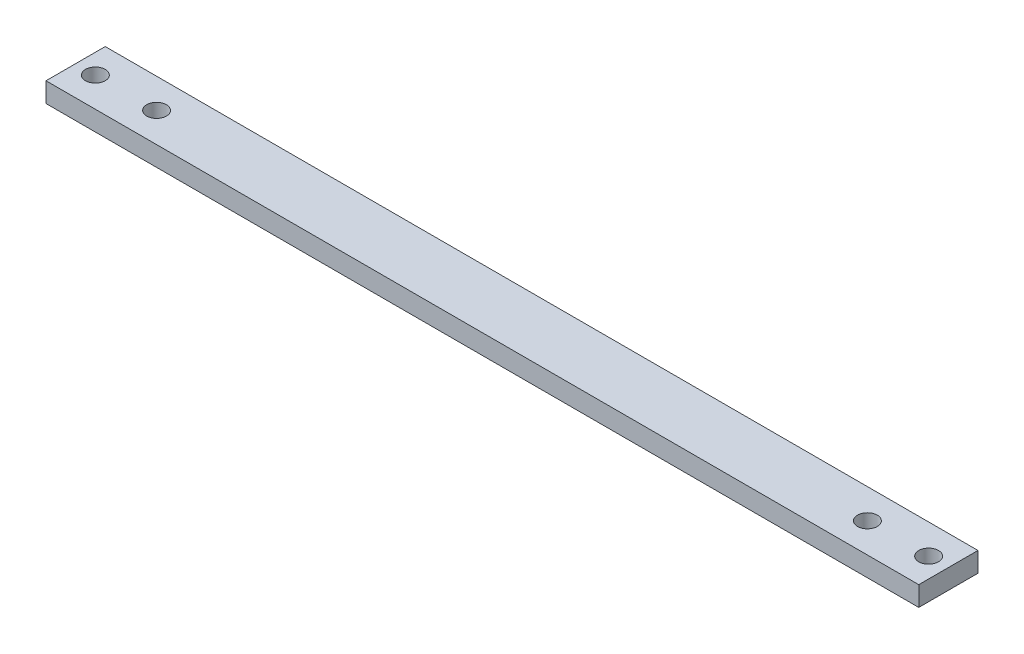
ISO-10303-21;
HEADER;
FILE_DESCRIPTION(('STEP AP214'),'2;1');
FILE_NAME('part.step','',(''),(''),'','','');
FILE_SCHEMA(('AUTOMOTIVE_DESIGN { 1 0 10303 214 1 1 1 1 }'));
ENDSEC;
DATA;
#1=APPLICATION_CONTEXT('core data for automotive mechanical design processes');
#2=APPLICATION_PROTOCOL_DEFINITION('international standard','automotive_design',2000,#1);
#3=PRODUCT_CONTEXT('',#1,'mechanical');
#4=PRODUCT('Part','Part','',(#3));
#5=PRODUCT_RELATED_PRODUCT_CATEGORY('part','',(#4));
#6=PRODUCT_DEFINITION_FORMATION('','',#4);
#7=PRODUCT_DEFINITION_CONTEXT('part definition',#1,'design');
#8=PRODUCT_DEFINITION('design','',#6,#7);
#9=PRODUCT_DEFINITION_SHAPE('','',#8);
#10=(LENGTH_UNIT() NAMED_UNIT(*) SI_UNIT(.MILLI.,.METRE.));
#11=(NAMED_UNIT(*) PLANE_ANGLE_UNIT() SI_UNIT($,.RADIAN.));
#12=(NAMED_UNIT(*) SI_UNIT($,.STERADIAN.) SOLID_ANGLE_UNIT());
#13=UNCERTAINTY_MEASURE_WITH_UNIT(LENGTH_MEASURE(1.E-05),#10,'distance_accuracy_value','');
#14=(GEOMETRIC_REPRESENTATION_CONTEXT(3) GLOBAL_UNCERTAINTY_ASSIGNED_CONTEXT((#13)) GLOBAL_UNIT_ASSIGNED_CONTEXT((#10,
#11,#12)) REPRESENTATION_CONTEXT('',''));
#15=CARTESIAN_POINT('',(0.,0.,0.));
#16=DIRECTION('',(0.,0.,1.));
#17=DIRECTION('',(1.,0.,0.));
#18=AXIS2_PLACEMENT_3D('',#15,#16,#17);
#19=CARTESIAN_POINT('',(0.,5.,0.));
#20=DIRECTION('',(0.,1.,0.));
#21=DIRECTION('',(0.,0.,1.));
#22=AXIS2_PLACEMENT_3D('',#19,#20,#21);
#23=PLANE('',#22);
#24=CARTESIAN_POINT('',(-105.5,5.,0.));
#25=DIRECTION('',(0.,1.,0.));
#26=DIRECTION('',(0.,0.,-1.));
#27=AXIS2_PLACEMENT_3D('',#24,#25,#26);
#28=CIRCLE('',#27,2.49999999999999);
#29=CARTESIAN_POINT('',(-105.5,5.,-2.5));
#30=VERTEX_POINT('',#29);
#31=EDGE_CURVE('E142',#30,#30,#28,.T.);
#32=ORIENTED_EDGE('',*,*,#31,.F.);
#33=EDGE_LOOP('',(#32));
#34=FACE_BOUND('',#33,.T.);
#35=CARTESIAN_POINT('',(105.5,5.,0.));
#36=DIRECTION('',(0.,1.,0.));
#37=DIRECTION('',(0.,0.,1.));
#38=AXIS2_PLACEMENT_3D('',#35,#36,#37);
#39=CIRCLE('',#38,2.49999999999999);
#40=CARTESIAN_POINT('',(105.5,5.,2.49999999999999));
#41=VERTEX_POINT('',#40);
#42=EDGE_CURVE('E112',#41,#41,#39,.T.);
#43=ORIENTED_EDGE('',*,*,#42,.F.);
#44=EDGE_LOOP('',(#43));
#45=FACE_BOUND('',#44,.T.);
#46=DIRECTION('',(0.,0.,-1.));
#47=VECTOR('',#46,1.);
#48=CARTESIAN_POINT('',(110.5,5.,-7.5));
#49=LINE('',#48,#47);
#50=CARTESIAN_POINT('',(110.5,5.,7.5));
#51=VERTEX_POINT('',#50);
#52=CARTESIAN_POINT('',(110.5,5.,-7.5));
#53=VERTEX_POINT('',#52);
#54=EDGE_CURVE('E92',#51,#53,#49,.T.);
#55=ORIENTED_EDGE('',*,*,#54,.T.);
#56=DIRECTION('',(-1.,0.,0.));
#57=VECTOR('',#56,1.);
#58=CARTESIAN_POINT('',(-110.5,5.,-7.5));
#59=LINE('',#58,#57);
#60=CARTESIAN_POINT('',(-110.5,5.,-7.5));
#61=VERTEX_POINT('',#60);
#62=EDGE_CURVE('E87',#53,#61,#59,.T.);
#63=ORIENTED_EDGE('',*,*,#62,.T.);
#64=DIRECTION('',(0.,0.,1.));
#65=VECTOR('',#64,1.);
#66=CARTESIAN_POINT('',(-110.5,5.,-7.5));
#67=LINE('',#66,#65);
#68=CARTESIAN_POINT('',(-110.5,5.,7.5));
#69=VERTEX_POINT('',#68);
#70=EDGE_CURVE('E90',#61,#69,#67,.T.);
#71=ORIENTED_EDGE('',*,*,#70,.T.);
#72=DIRECTION('',(1.,0.,0.));
#73=VECTOR('',#72,1.);
#74=CARTESIAN_POINT('',(-110.5,5.,7.5));
#75=LINE('',#74,#73);
#76=EDGE_CURVE('E57',#69,#51,#75,.T.);
#77=ORIENTED_EDGE('',*,*,#76,.T.);
#78=EDGE_LOOP('',(#55,#63,#71,#77));
#79=FACE_BOUND('',#78,.T.);
#80=CARTESIAN_POINT('',(90.,5.,0.));
#81=DIRECTION('',(0.,1.,0.));
#82=DIRECTION('',(0.,0.,1.));
#83=AXIS2_PLACEMENT_3D('',#80,#81,#82);
#84=CIRCLE('',#83,2.5);
#85=CARTESIAN_POINT('',(90.,5.,2.5));
#86=VERTEX_POINT('',#85);
#87=EDGE_CURVE('E134',#86,#86,#84,.T.);
#88=ORIENTED_EDGE('',*,*,#87,.F.);
#89=EDGE_LOOP('',(#88));
#90=FACE_BOUND('',#89,.T.);
#91=CARTESIAN_POINT('',(-90.0000000000001,5.,0.));
#92=DIRECTION('',(0.,1.,0.));
#93=DIRECTION('',(0.,0.,-1.));
#94=AXIS2_PLACEMENT_3D('',#91,#92,#93);
#95=CIRCLE('',#94,2.5);
#96=CARTESIAN_POINT('',(-90.0000000000001,5.,-2.5));
#97=VERTEX_POINT('',#96);
#98=EDGE_CURVE('E150',#97,#97,#95,.T.);
#99=ORIENTED_EDGE('',*,*,#98,.F.);
#100=EDGE_LOOP('',(#99));
#101=FACE_BOUND('',#100,.T.);
#102=ADVANCED_FACE('F39',(#34,#45,#79,#90,#101),#23,.T.);
#103=CARTESIAN_POINT('',(0.,0.,0.));
#104=DIRECTION('',(0.,1.,0.));
#105=DIRECTION('',(0.,0.,1.));
#106=AXIS2_PLACEMENT_3D('',#103,#104,#105);
#107=PLANE('',#106);
#108=DIRECTION('',(0.,0.,-1.));
#109=VECTOR('',#108,1.);
#110=CARTESIAN_POINT('',(110.5,0.,-7.5));
#111=LINE('',#110,#109);
#112=CARTESIAN_POINT('',(110.5,0.,7.5));
#113=VERTEX_POINT('',#112);
#114=CARTESIAN_POINT('',(110.5,0.,-7.5));
#115=VERTEX_POINT('',#114);
#116=EDGE_CURVE('E108',#113,#115,#111,.T.);
#117=ORIENTED_EDGE('',*,*,#116,.F.);
#118=DIRECTION('',(1.,0.,0.));
#119=VECTOR('',#118,1.);
#120=CARTESIAN_POINT('',(-110.5,0.,7.5));
#121=LINE('',#120,#119);
#122=CARTESIAN_POINT('',(-110.5,0.,7.5));
#123=VERTEX_POINT('',#122);
#124=EDGE_CURVE('E80',#123,#113,#121,.T.);
#125=ORIENTED_EDGE('',*,*,#124,.F.);
#126=DIRECTION('',(0.,0.,1.));
#127=VECTOR('',#126,1.);
#128=CARTESIAN_POINT('',(-110.5,0.,-7.5));
#129=LINE('',#128,#127);
#130=CARTESIAN_POINT('',(-110.5,0.,-7.5));
#131=VERTEX_POINT('',#130);
#132=EDGE_CURVE('E74',#131,#123,#129,.T.);
#133=ORIENTED_EDGE('',*,*,#132,.F.);
#134=DIRECTION('',(-1.,0.,0.));
#135=VECTOR('',#134,1.);
#136=CARTESIAN_POINT('',(-110.5,0.,-7.5));
#137=LINE('',#136,#135);
#138=EDGE_CURVE('E97',#115,#131,#137,.T.);
#139=ORIENTED_EDGE('',*,*,#138,.F.);
#140=EDGE_LOOP('',(#117,#125,#133,#139));
#141=FACE_BOUND('',#140,.T.);
#142=CARTESIAN_POINT('',(105.5,0.,0.));
#143=DIRECTION('',(0.,1.,0.));
#144=DIRECTION('',(0.,0.,1.));
#145=AXIS2_PLACEMENT_3D('',#142,#143,#144);
#146=CIRCLE('',#145,2.49999999999999);
#147=CARTESIAN_POINT('',(105.5,0.,2.49999999999999));
#148=VERTEX_POINT('',#147);
#149=EDGE_CURVE('E130',#148,#148,#146,.T.);
#150=ORIENTED_EDGE('',*,*,#149,.T.);
#151=EDGE_LOOP('',(#150));
#152=FACE_BOUND('',#151,.T.);
#153=CARTESIAN_POINT('',(90.,0.,0.));
#154=DIRECTION('',(0.,1.,0.));
#155=DIRECTION('',(0.,0.,1.));
#156=AXIS2_PLACEMENT_3D('',#153,#154,#155);
#157=CIRCLE('',#156,2.5);
#158=CARTESIAN_POINT('',(90.,0.,2.5));
#159=VERTEX_POINT('',#158);
#160=EDGE_CURVE('E138',#159,#159,#157,.T.);
#161=ORIENTED_EDGE('',*,*,#160,.T.);
#162=EDGE_LOOP('',(#161));
#163=FACE_BOUND('',#162,.T.);
#164=CARTESIAN_POINT('',(-105.5,0.,0.));
#165=DIRECTION('',(0.,1.,0.));
#166=DIRECTION('',(0.,0.,-1.));
#167=AXIS2_PLACEMENT_3D('',#164,#165,#166);
#168=CIRCLE('',#167,2.49999999999999);
#169=CARTESIAN_POINT('',(-105.5,0.,-2.5));
#170=VERTEX_POINT('',#169);
#171=EDGE_CURVE('E146',#170,#170,#168,.T.);
#172=ORIENTED_EDGE('',*,*,#171,.T.);
#173=EDGE_LOOP('',(#172));
#174=FACE_BOUND('',#173,.T.);
#175=CARTESIAN_POINT('',(-90.0000000000001,0.,0.));
#176=DIRECTION('',(0.,1.,0.));
#177=DIRECTION('',(0.,0.,-1.));
#178=AXIS2_PLACEMENT_3D('',#175,#176,#177);
#179=CIRCLE('',#178,2.5);
#180=CARTESIAN_POINT('',(-90.0000000000001,0.,-2.5));
#181=VERTEX_POINT('',#180);
#182=EDGE_CURVE('E154',#181,#181,#179,.T.);
#183=ORIENTED_EDGE('',*,*,#182,.T.);
#184=EDGE_LOOP('',(#183));
#185=FACE_BOUND('',#184,.T.);
#186=ADVANCED_FACE('F125',(#141,#152,#163,#174,#185),#107,.F.);
#187=CARTESIAN_POINT('',(110.5,5.,-7.5));
#188=DIRECTION('',(-1.,0.,0.));
#189=DIRECTION('',(0.,0.,1.));
#190=AXIS2_PLACEMENT_3D('',#187,#188,#189);
#191=PLANE('',#190);
#192=ORIENTED_EDGE('',*,*,#116,.T.);
#193=DIRECTION('',(0.,-1.,0.));
#194=VECTOR('',#193,1.);
#195=CARTESIAN_POINT('',(110.5,5.,-7.5));
#196=LINE('',#195,#194);
#197=EDGE_CURVE('E11',#53,#115,#196,.T.);
#198=ORIENTED_EDGE('',*,*,#197,.F.);
#199=ORIENTED_EDGE('',*,*,#54,.F.);
#200=DIRECTION('',(0.,-1.,0.));
#201=VECTOR('',#200,1.);
#202=CARTESIAN_POINT('',(110.5,5.,7.5));
#203=LINE('',#202,#201);
#204=EDGE_CURVE('E104',#51,#113,#203,.T.);
#205=ORIENTED_EDGE('',*,*,#204,.T.);
#206=EDGE_LOOP('',(#192,#198,#199,#205));
#207=FACE_BOUND('',#206,.T.);
#208=ADVANCED_FACE('F41',(#207),#191,.F.);
#209=CARTESIAN_POINT('',(-110.5,5.,-7.5));
#210=DIRECTION('',(0.,0.,1.));
#211=DIRECTION('',(1.,0.,0.));
#212=AXIS2_PLACEMENT_3D('',#209,#210,#211);
#213=PLANE('',#212);
#214=ORIENTED_EDGE('',*,*,#138,.T.);
#215=DIRECTION('',(0.,-1.,0.));
#216=VECTOR('',#215,1.);
#217=CARTESIAN_POINT('',(-110.5,5.,-7.5));
#218=LINE('',#217,#216);
#219=EDGE_CURVE('E49',#61,#131,#218,.T.);
#220=ORIENTED_EDGE('',*,*,#219,.F.);
#221=ORIENTED_EDGE('',*,*,#62,.F.);
#222=ORIENTED_EDGE('',*,*,#197,.T.);
#223=EDGE_LOOP('',(#214,#220,#221,#222));
#224=FACE_BOUND('',#223,.T.);
#225=ADVANCED_FACE('F96',(#224),#213,.F.);
#226=CARTESIAN_POINT('',(-110.5,5.,-7.5));
#227=DIRECTION('',(1.,0.,0.));
#228=DIRECTION('',(0.,0.,-1.));
#229=AXIS2_PLACEMENT_3D('',#226,#227,#228);
#230=PLANE('',#229);
#231=ORIENTED_EDGE('',*,*,#132,.T.);
#232=DIRECTION('',(0.,-1.,0.));
#233=VECTOR('',#232,1.);
#234=CARTESIAN_POINT('',(-110.5,5.,7.5));
#235=LINE('',#234,#233);
#236=EDGE_CURVE('E99',#69,#123,#235,.T.);
#237=ORIENTED_EDGE('',*,*,#236,.F.);
#238=ORIENTED_EDGE('',*,*,#70,.F.);
#239=ORIENTED_EDGE('',*,*,#219,.T.);
#240=EDGE_LOOP('',(#231,#237,#238,#239));
#241=FACE_BOUND('',#240,.T.);
#242=ADVANCED_FACE('F100',(#241),#230,.F.);
#243=CARTESIAN_POINT('',(-110.5,5.,7.5));
#244=DIRECTION('',(0.,0.,-1.));
#245=DIRECTION('',(-1.,0.,0.));
#246=AXIS2_PLACEMENT_3D('',#243,#244,#245);
#247=PLANE('',#246);
#248=ORIENTED_EDGE('',*,*,#124,.T.);
#249=ORIENTED_EDGE('',*,*,#204,.F.);
#250=ORIENTED_EDGE('',*,*,#76,.F.);
#251=ORIENTED_EDGE('',*,*,#236,.T.);
#252=EDGE_LOOP('',(#248,#249,#250,#251));
#253=FACE_BOUND('',#252,.T.);
#254=ADVANCED_FACE('F122',(#253),#247,.F.);
#255=CARTESIAN_POINT('',(105.5,5.,0.));
#256=DIRECTION('',(0.,-1.,0.));
#257=DIRECTION('',(0.,0.,-1.));
#258=AXIS2_PLACEMENT_3D('',#255,#256,#257);
#259=CYLINDRICAL_SURFACE('',#258,2.49999999999999);
#260=ORIENTED_EDGE('',*,*,#42,.T.);
#261=EDGE_LOOP('',(#260));
#262=FACE_BOUND('',#261,.T.);
#263=ORIENTED_EDGE('',*,*,#149,.F.);
#264=EDGE_LOOP('',(#263));
#265=FACE_BOUND('',#264,.T.);
#266=ADVANCED_FACE('F175',(#262,#265),#259,.F.);
#267=CARTESIAN_POINT('',(90.,5.,0.));
#268=DIRECTION('',(0.,-1.,0.));
#269=DIRECTION('',(0.,0.,-1.));
#270=AXIS2_PLACEMENT_3D('',#267,#268,#269);
#271=CYLINDRICAL_SURFACE('',#270,2.5);
#272=ORIENTED_EDGE('',*,*,#87,.T.);
#273=EDGE_LOOP('',(#272));
#274=FACE_BOUND('',#273,.T.);
#275=ORIENTED_EDGE('',*,*,#160,.F.);
#276=EDGE_LOOP('',(#275));
#277=FACE_BOUND('',#276,.T.);
#278=ADVANCED_FACE('F221',(#274,#277),#271,.F.);
#279=CARTESIAN_POINT('',(-105.5,5.,0.));
#280=DIRECTION('',(0.,-1.,0.));
#281=DIRECTION('',(0.,0.,-1.));
#282=AXIS2_PLACEMENT_3D('',#279,#280,#281);
#283=CYLINDRICAL_SURFACE('',#282,2.49999999999999);
#284=ORIENTED_EDGE('',*,*,#31,.T.);
#285=EDGE_LOOP('',(#284));
#286=FACE_BOUND('',#285,.T.);
#287=ORIENTED_EDGE('',*,*,#171,.F.);
#288=EDGE_LOOP('',(#287));
#289=FACE_BOUND('',#288,.T.);
#290=ADVANCED_FACE('F229',(#286,#289),#283,.F.);
#291=CARTESIAN_POINT('',(-90.0000000000001,5.,0.));
#292=DIRECTION('',(0.,-1.,0.));
#293=DIRECTION('',(0.,0.,-1.));
#294=AXIS2_PLACEMENT_3D('',#291,#292,#293);
#295=CYLINDRICAL_SURFACE('',#294,2.5);
#296=ORIENTED_EDGE('',*,*,#98,.T.);
#297=EDGE_LOOP('',(#296));
#298=FACE_BOUND('',#297,.T.);
#299=ORIENTED_EDGE('',*,*,#182,.F.);
#300=EDGE_LOOP('',(#299));
#301=FACE_BOUND('',#300,.T.);
#302=ADVANCED_FACE('F162',(#298,#301),#295,.F.);
#303=CLOSED_SHELL('',(#102,#186,#208,#225,#242,#254,#266,#278,#290,#302));
#304=MANIFOLD_SOLID_BREP('B2',#303);
#305=ADVANCED_BREP_SHAPE_REPRESENTATION('',(#18,#304),#14);
#306=SHAPE_DEFINITION_REPRESENTATION(#9,#305);
ENDSEC;
END-ISO-10303-21;
